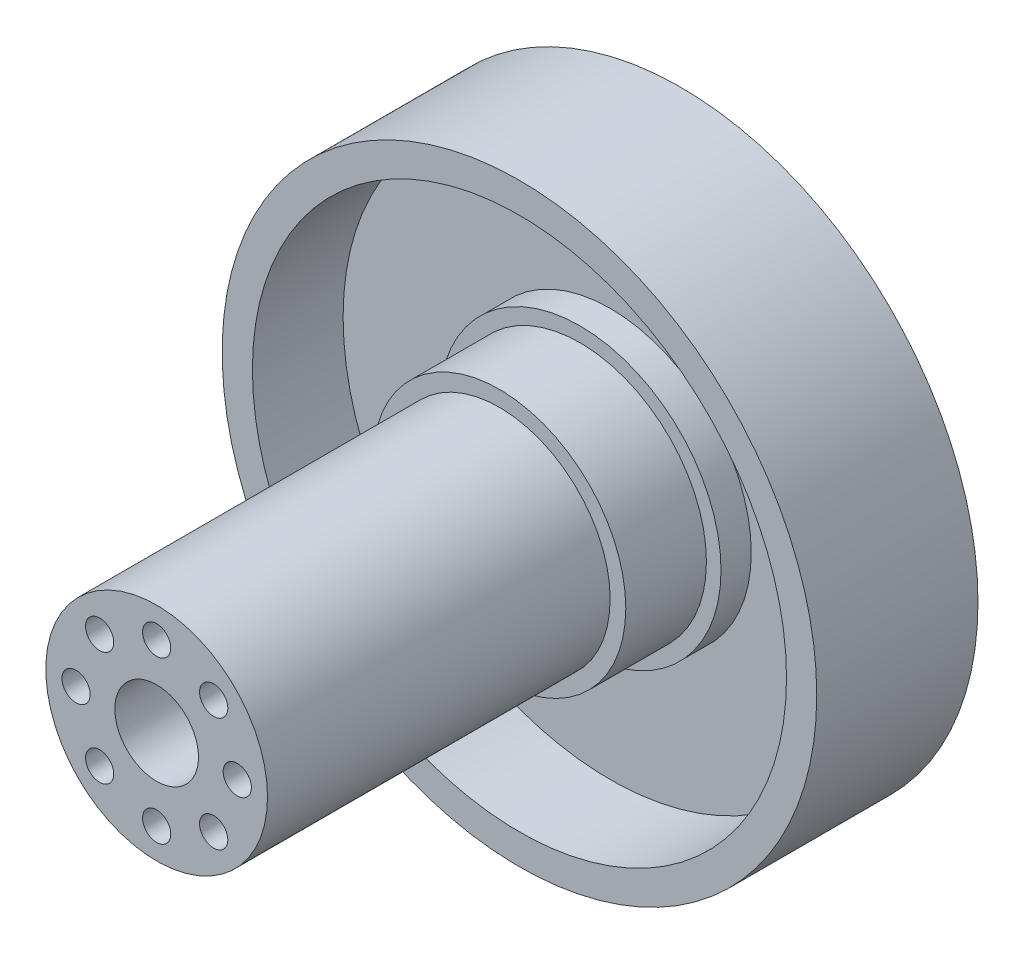
ISO-10303-21;
HEADER;
FILE_DESCRIPTION(('STEP AP214'),'2;1');
FILE_NAME('part.step','',(''),(''),'','','');
FILE_SCHEMA(('AUTOMOTIVE_DESIGN { 1 0 10303 214 1 1 1 1 }'));
ENDSEC;
DATA;
#1=APPLICATION_CONTEXT('core data for automotive mechanical design processes');
#2=APPLICATION_PROTOCOL_DEFINITION('international standard','automotive_design',2000,#1);
#3=PRODUCT_CONTEXT('',#1,'mechanical');
#4=PRODUCT('Part','Part','',(#3));
#5=PRODUCT_RELATED_PRODUCT_CATEGORY('part','',(#4));
#6=PRODUCT_DEFINITION_FORMATION('','',#4);
#7=PRODUCT_DEFINITION_CONTEXT('part definition',#1,'design');
#8=PRODUCT_DEFINITION('design','',#6,#7);
#9=PRODUCT_DEFINITION_SHAPE('','',#8);
#10=(LENGTH_UNIT() NAMED_UNIT(*) SI_UNIT(.MILLI.,.METRE.));
#11=(NAMED_UNIT(*) PLANE_ANGLE_UNIT() SI_UNIT($,.RADIAN.));
#12=(NAMED_UNIT(*) SI_UNIT($,.STERADIAN.) SOLID_ANGLE_UNIT());
#13=UNCERTAINTY_MEASURE_WITH_UNIT(LENGTH_MEASURE(1.E-05),#10,'distance_accuracy_value','');
#14=(GEOMETRIC_REPRESENTATION_CONTEXT(3) GLOBAL_UNCERTAINTY_ASSIGNED_CONTEXT((#13)) GLOBAL_UNIT_ASSIGNED_CONTEXT((#10,
#11,#12)) REPRESENTATION_CONTEXT('',''));
#15=CARTESIAN_POINT('',(0.,0.,0.));
#16=DIRECTION('',(0.,0.,1.));
#17=DIRECTION('',(1.,0.,0.));
#18=AXIS2_PLACEMENT_3D('',#15,#16,#17);
#19=CARTESIAN_POINT('',(0.,0.,7.));
#20=DIRECTION('',(0.,0.,-1.));
#21=DIRECTION('',(-1.,0.,0.));
#22=AXIS2_PLACEMENT_3D('',#19,#20,#21);
#23=CYLINDRICAL_SURFACE('',#22,29.5);
#24=CARTESIAN_POINT('',(0.,0.,0.));
#25=DIRECTION('',(0.,0.,1.));
#26=DIRECTION('',(1.,0.,0.));
#27=AXIS2_PLACEMENT_3D('',#24,#25,#26);
#28=CIRCLE('',#27,29.5);
#29=CARTESIAN_POINT('',(29.5,0.,0.));
#30=VERTEX_POINT('',#29);
#31=EDGE_CURVE('E76',#30,#30,#28,.T.);
#32=ORIENTED_EDGE('',*,*,#31,.T.);
#33=EDGE_LOOP('',(#32));
#34=FACE_BOUND('',#33,.T.);
#35=CARTESIAN_POINT('',(0.,0.,16.));
#36=DIRECTION('',(0.,0.,1.));
#37=DIRECTION('',(1.,0.,0.));
#38=AXIS2_PLACEMENT_3D('',#35,#36,#37);
#39=CIRCLE('',#38,29.5);
#40=CARTESIAN_POINT('',(29.5,0.,16.));
#41=VERTEX_POINT('',#40);
#42=EDGE_CURVE('E689',#41,#41,#39,.T.);
#43=ORIENTED_EDGE('',*,*,#42,.F.);
#44=EDGE_LOOP('',(#43));
#45=FACE_BOUND('',#44,.T.);
#46=ADVANCED_FACE('F44',(#34,#45),#23,.T.);
#47=CARTESIAN_POINT('',(0.,0.,7.));
#48=DIRECTION('',(0.,0.,1.));
#49=DIRECTION('',(1.,0.,0.));
#50=AXIS2_PLACEMENT_3D('',#47,#48,#49);
#51=PLANE('',#50);
#52=CARTESIAN_POINT('',(0.,0.,7.));
#53=DIRECTION('',(0.,0.,1.));
#54=DIRECTION('',(1.,0.,0.));
#55=AXIS2_PLACEMENT_3D('',#52,#53,#54);
#56=CIRCLE('',#55,26.5);
#57=CARTESIAN_POINT('',(26.5,0.,7.));
#58=VERTEX_POINT('',#57);
#59=EDGE_CURVE('E10',#58,#58,#56,.F.);
#60=ORIENTED_EDGE('',*,*,#59,.F.);
#61=EDGE_LOOP('',(#60));
#62=FACE_BOUND('',#61,.T.);
#63=CARTESIAN_POINT('',(0.,0.,7.));
#64=DIRECTION('',(0.,0.,1.));
#65=DIRECTION('',(1.,0.,0.));
#66=AXIS2_PLACEMENT_3D('',#63,#64,#65);
#67=CIRCLE('',#66,14.);
#68=CARTESIAN_POINT('',(14.,0.,7.));
#69=VERTEX_POINT('',#68);
#70=EDGE_CURVE('E62',#69,#69,#67,.T.);
#71=ORIENTED_EDGE('',*,*,#70,.F.);
#72=EDGE_LOOP('',(#71));
#73=FACE_BOUND('',#72,.T.);
#74=ADVANCED_FACE('F88',(#62,#73),#51,.T.);
#75=CARTESIAN_POINT('',(0.,0.,0.));
#76=DIRECTION('',(0.,0.,1.));
#77=DIRECTION('',(1.,0.,0.));
#78=AXIS2_PLACEMENT_3D('',#75,#76,#77);
#79=PLANE('',#78);
#80=CARTESIAN_POINT('',(-26.,0.,0.));
#81=DIRECTION('',(0.,0.,1.));
#82=DIRECTION('',(1.,0.,0.));
#83=AXIS2_PLACEMENT_3D('',#80,#81,#82);
#84=CIRCLE('',#83,2.07);
#85=CARTESIAN_POINT('',(-23.93,0.,0.));
#86=VERTEX_POINT('',#85);
#87=EDGE_CURVE('E709',#86,#86,#84,.T.);
#88=ORIENTED_EDGE('',*,*,#87,.T.);
#89=EDGE_LOOP('',(#88));
#90=FACE_BOUND('',#89,.T.);
#91=CARTESIAN_POINT('',(0.,26.,0.));
#92=DIRECTION('',(0.,0.,1.));
#93=DIRECTION('',(1.,0.,0.));
#94=AXIS2_PLACEMENT_3D('',#91,#92,#93);
#95=CIRCLE('',#94,2.07);
#96=CARTESIAN_POINT('',(2.07000000000009,26.,0.));
#97=VERTEX_POINT('',#96);
#98=EDGE_CURVE('E705',#97,#97,#95,.T.);
#99=ORIENTED_EDGE('',*,*,#98,.T.);
#100=EDGE_LOOP('',(#99));
#101=FACE_BOUND('',#100,.T.);
#102=CARTESIAN_POINT('',(26.,-1.81557029619843E-13,0.));
#103=DIRECTION('',(0.,0.,1.));
#104=DIRECTION('',(1.,0.,0.));
#105=AXIS2_PLACEMENT_3D('',#102,#103,#104);
#106=CIRCLE('',#105,2.07);
#107=CARTESIAN_POINT('',(28.07,-1.81557029619843E-13,0.));
#108=VERTEX_POINT('',#107);
#109=EDGE_CURVE('E697',#108,#108,#106,.T.);
#110=ORIENTED_EDGE('',*,*,#109,.T.);
#111=EDGE_LOOP('',(#110));
#112=FACE_BOUND('',#111,.T.);
#113=CARTESIAN_POINT('',(-2.72335544429764E-13,-26.,0.));
#114=DIRECTION('',(0.,0.,1.));
#115=DIRECTION('',(1.,0.,0.));
#116=AXIS2_PLACEMENT_3D('',#113,#114,#115);
#117=CIRCLE('',#116,2.07);
#118=CARTESIAN_POINT('',(2.06999999999973,-26.,0.));
#119=VERTEX_POINT('',#118);
#120=EDGE_CURVE('E688',#119,#119,#117,.T.);
#121=ORIENTED_EDGE('',*,*,#120,.T.);
#122=EDGE_LOOP('',(#121));
#123=FACE_BOUND('',#122,.T.);
#124=CARTESIAN_POINT('',(8.,0.,0.));
#125=DIRECTION('',(0.,0.,-1.));
#126=DIRECTION('',(-1.,0.,0.));
#127=AXIS2_PLACEMENT_3D('',#124,#125,#126);
#128=CIRCLE('',#127,2.1);
#129=CARTESIAN_POINT('',(5.9,0.,0.));
#130=VERTEX_POINT('',#129);
#131=EDGE_CURVE('E554',#130,#130,#128,.T.);
#132=ORIENTED_EDGE('',*,*,#131,.F.);
#133=EDGE_LOOP('',(#132));
#134=FACE_BOUND('',#133,.T.);
#135=CARTESIAN_POINT('',(5.65685424949233,5.65685424949243,0.));
#136=DIRECTION('',(0.,0.,-1.));
#137=DIRECTION('',(-1.,0.,0.));
#138=AXIS2_PLACEMENT_3D('',#135,#136,#137);
#139=CIRCLE('',#138,2.1);
#140=CARTESIAN_POINT('',(3.55685424949233,5.65685424949243,0.));
#141=VERTEX_POINT('',#140);
#142=EDGE_CURVE('E577',#141,#141,#139,.T.);
#143=ORIENTED_EDGE('',*,*,#142,.F.);
#144=EDGE_LOOP('',(#143));
#145=FACE_BOUND('',#144,.T.);
#146=CARTESIAN_POINT('',(0.,8.,0.));
#147=DIRECTION('',(0.,0.,-1.));
#148=DIRECTION('',(-1.,0.,0.));
#149=AXIS2_PLACEMENT_3D('',#146,#147,#148);
#150=CIRCLE('',#149,2.1);
#151=CARTESIAN_POINT('',(-2.10000000000009,8.,0.));
#152=VERTEX_POINT('',#151);
#153=EDGE_CURVE('E569',#152,#152,#150,.T.);
#154=ORIENTED_EDGE('',*,*,#153,.F.);
#155=EDGE_LOOP('',(#154));
#156=FACE_BOUND('',#155,.T.);
#157=CARTESIAN_POINT('',(-5.65685424949245,5.65685424949231,0.));
#158=DIRECTION('',(0.,0.,-1.));
#159=DIRECTION('',(-1.,0.,0.));
#160=AXIS2_PLACEMENT_3D('',#157,#158,#159);
#161=CIRCLE('',#160,2.1);
#162=CARTESIAN_POINT('',(-7.75685424949245,5.65685424949231,0.));
#163=VERTEX_POINT('',#162);
#164=EDGE_CURVE('E560',#163,#163,#161,.T.);
#165=ORIENTED_EDGE('',*,*,#164,.F.);
#166=EDGE_LOOP('',(#165));
#167=FACE_BOUND('',#166,.T.);
#168=CARTESIAN_POINT('',(-8.,0.,0.));
#169=DIRECTION('',(0.,0.,-1.));
#170=DIRECTION('',(-1.,0.,0.));
#171=AXIS2_PLACEMENT_3D('',#168,#169,#170);
#172=CIRCLE('',#171,2.1);
#173=CARTESIAN_POINT('',(-10.1,0.,0.));
#174=VERTEX_POINT('',#173);
#175=EDGE_CURVE('E561',#174,#174,#172,.T.);
#176=ORIENTED_EDGE('',*,*,#175,.F.);
#177=EDGE_LOOP('',(#176));
#178=FACE_BOUND('',#177,.T.);
#179=CARTESIAN_POINT('',(-5.65685424949237,-5.65685424949239,0.));
#180=DIRECTION('',(0.,0.,-1.));
#181=DIRECTION('',(-1.,0.,0.));
#182=AXIS2_PLACEMENT_3D('',#179,#180,#181);
#183=CIRCLE('',#182,2.1);
#184=CARTESIAN_POINT('',(-7.75685424949237,-5.65685424949239,0.));
#185=VERTEX_POINT('',#184);
#186=EDGE_CURVE('E601',#185,#185,#183,.T.);
#187=ORIENTED_EDGE('',*,*,#186,.F.);
#188=EDGE_LOOP('',(#187));
#189=FACE_BOUND('',#188,.T.);
#190=CARTESIAN_POINT('',(0.,-8.,0.));
#191=DIRECTION('',(0.,0.,-1.));
#192=DIRECTION('',(-1.,0.,0.));
#193=AXIS2_PLACEMENT_3D('',#190,#191,#192);
#194=CIRCLE('',#193,2.1);
#195=CARTESIAN_POINT('',(-2.09999999999997,-8.,0.));
#196=VERTEX_POINT('',#195);
#197=EDGE_CURVE('E592',#196,#196,#194,.T.);
#198=ORIENTED_EDGE('',*,*,#197,.F.);
#199=EDGE_LOOP('',(#198));
#200=FACE_BOUND('',#199,.T.);
#201=CARTESIAN_POINT('',(5.65685424949241,-5.65685424949235,0.));
#202=DIRECTION('',(0.,0.,-1.));
#203=DIRECTION('',(-1.,0.,0.));
#204=AXIS2_PLACEMENT_3D('',#201,#202,#203);
#205=CIRCLE('',#204,2.1);
#206=CARTESIAN_POINT('',(3.55685424949241,-5.65685424949235,0.));
#207=VERTEX_POINT('',#206);
#208=EDGE_CURVE('E548',#207,#207,#205,.T.);
#209=ORIENTED_EDGE('',*,*,#208,.F.);
#210=EDGE_LOOP('',(#209));
#211=FACE_BOUND('',#210,.T.);
#212=ORIENTED_EDGE('',*,*,#31,.F.);
#213=EDGE_LOOP('',(#212));
#214=FACE_BOUND('',#213,.T.);
#215=ADVANCED_FACE('F85',(#90,#101,#112,#123,#134,#145,#156,#167,#178,#189,#200,#211,#214),#79,.F.);
#216=CARTESIAN_POINT('',(0.,0.,10.));
#217=DIRECTION('',(0.,0.,-1.));
#218=DIRECTION('',(-1.,0.,0.));
#219=AXIS2_PLACEMENT_3D('',#216,#217,#218);
#220=CYLINDRICAL_SURFACE('',#219,14.);
#221=CARTESIAN_POINT('',(0.,0.,10.));
#222=DIRECTION('',(0.,0.,1.));
#223=DIRECTION('',(1.,0.,0.));
#224=AXIS2_PLACEMENT_3D('',#221,#222,#223);
#225=CIRCLE('',#224,14.);
#226=CARTESIAN_POINT('',(14.,0.,10.));
#227=VERTEX_POINT('',#226);
#228=EDGE_CURVE('E71',#227,#227,#225,.T.);
#229=ORIENTED_EDGE('',*,*,#228,.F.);
#230=EDGE_LOOP('',(#229));
#231=FACE_BOUND('',#230,.T.);
#232=ORIENTED_EDGE('',*,*,#70,.T.);
#233=EDGE_LOOP('',(#232));
#234=FACE_BOUND('',#233,.T.);
#235=ADVANCED_FACE('F87',(#231,#234),#220,.T.);
#236=CARTESIAN_POINT('',(0.,0.,10.));
#237=DIRECTION('',(0.,0.,1.));
#238=DIRECTION('',(1.,0.,0.));
#239=AXIS2_PLACEMENT_3D('',#236,#237,#238);
#240=PLANE('',#239);
#241=CARTESIAN_POINT('',(0.,0.,10.));
#242=DIRECTION('',(0.,0.,1.));
#243=DIRECTION('',(1.,0.,0.));
#244=AXIS2_PLACEMENT_3D('',#241,#242,#243);
#245=CIRCLE('',#244,12.55);
#246=CARTESIAN_POINT('',(12.55,0.,10.));
#247=VERTEX_POINT('',#246);
#248=EDGE_CURVE('E56',#247,#247,#245,.T.);
#249=ORIENTED_EDGE('',*,*,#248,.F.);
#250=EDGE_LOOP('',(#249));
#251=FACE_BOUND('',#250,.T.);
#252=ORIENTED_EDGE('',*,*,#228,.T.);
#253=EDGE_LOOP('',(#252));
#254=FACE_BOUND('',#253,.T.);
#255=ADVANCED_FACE('F95',(#251,#254),#240,.T.);
#256=CARTESIAN_POINT('',(0.,0.,18.));
#257=DIRECTION('',(0.,0.,-1.));
#258=DIRECTION('',(-1.,0.,0.));
#259=AXIS2_PLACEMENT_3D('',#256,#257,#258);
#260=CYLINDRICAL_SURFACE('',#259,12.55);
#261=CARTESIAN_POINT('',(0.,0.,18.));
#262=DIRECTION('',(0.,0.,1.));
#263=DIRECTION('',(1.,0.,0.));
#264=AXIS2_PLACEMENT_3D('',#261,#262,#263);
#265=CIRCLE('',#264,12.55);
#266=CARTESIAN_POINT('',(12.55,0.,18.));
#267=VERTEX_POINT('',#266);
#268=EDGE_CURVE('E68',#267,#267,#265,.T.);
#269=ORIENTED_EDGE('',*,*,#268,.F.);
#270=EDGE_LOOP('',(#269));
#271=FACE_BOUND('',#270,.T.);
#272=ORIENTED_EDGE('',*,*,#248,.T.);
#273=EDGE_LOOP('',(#272));
#274=FACE_BOUND('',#273,.T.);
#275=ADVANCED_FACE('F464',(#271,#274),#260,.T.);
#276=CARTESIAN_POINT('',(0.,0.,18.));
#277=DIRECTION('',(0.,0.,1.));
#278=DIRECTION('',(1.,0.,0.));
#279=AXIS2_PLACEMENT_3D('',#276,#277,#278);
#280=PLANE('',#279);
#281=CARTESIAN_POINT('',(0.,0.,18.));
#282=DIRECTION('',(0.,0.,1.));
#283=DIRECTION('',(1.,0.,0.));
#284=AXIS2_PLACEMENT_3D('',#281,#282,#283);
#285=CIRCLE('',#284,11.);
#286=CARTESIAN_POINT('',(11.,0.,18.));
#287=VERTEX_POINT('',#286);
#288=EDGE_CURVE('E51',#287,#287,#285,.T.);
#289=ORIENTED_EDGE('',*,*,#288,.F.);
#290=EDGE_LOOP('',(#289));
#291=FACE_BOUND('',#290,.T.);
#292=ORIENTED_EDGE('',*,*,#268,.T.);
#293=EDGE_LOOP('',(#292));
#294=FACE_BOUND('',#293,.T.);
#295=ADVANCED_FACE('F455',(#291,#294),#280,.T.);
#296=CARTESIAN_POINT('',(0.,0.,52.));
#297=DIRECTION('',(0.,0.,-1.));
#298=DIRECTION('',(-1.,0.,0.));
#299=AXIS2_PLACEMENT_3D('',#296,#297,#298);
#300=CYLINDRICAL_SURFACE('',#299,11.);
#301=CARTESIAN_POINT('',(0.,0.,52.));
#302=DIRECTION('',(0.,0.,1.));
#303=DIRECTION('',(1.,0.,0.));
#304=AXIS2_PLACEMENT_3D('',#301,#302,#303);
#305=CIRCLE('',#304,11.);
#306=CARTESIAN_POINT('',(11.,0.,52.));
#307=VERTEX_POINT('',#306);
#308=EDGE_CURVE('E66',#307,#307,#305,.T.);
#309=ORIENTED_EDGE('',*,*,#308,.F.);
#310=EDGE_LOOP('',(#309));
#311=FACE_BOUND('',#310,.T.);
#312=ORIENTED_EDGE('',*,*,#288,.T.);
#313=EDGE_LOOP('',(#312));
#314=FACE_BOUND('',#313,.T.);
#315=ADVANCED_FACE('F446',(#311,#314),#300,.T.);
#316=CARTESIAN_POINT('',(0.,0.,52.));
#317=DIRECTION('',(0.,0.,1.));
#318=DIRECTION('',(1.,0.,0.));
#319=AXIS2_PLACEMENT_3D('',#316,#317,#318);
#320=PLANE('',#319);
#321=CARTESIAN_POINT('',(0.,0.,52.));
#322=DIRECTION('',(0.,0.,1.));
#323=DIRECTION('',(1.,0.,0.));
#324=AXIS2_PLACEMENT_3D('',#321,#322,#323);
#325=CIRCLE('',#324,4.15);
#326=CARTESIAN_POINT('',(4.15,0.,52.));
#327=VERTEX_POINT('',#326);
#328=EDGE_CURVE('E676',#327,#327,#325,.T.);
#329=ORIENTED_EDGE('',*,*,#328,.F.);
#330=EDGE_LOOP('',(#329));
#331=FACE_BOUND('',#330,.T.);
#332=CARTESIAN_POINT('',(5.65685424949249,-5.65685424949227,52.));
#333=DIRECTION('',(0.,0.,-1.));
#334=DIRECTION('',(-1.,0.,0.));
#335=AXIS2_PLACEMENT_3D('',#332,#333,#334);
#336=CIRCLE('',#335,1.4);
#337=CARTESIAN_POINT('',(4.25685424949249,-5.65685424949227,52.));
#338=VERTEX_POINT('',#337);
#339=EDGE_CURVE('E620',#338,#338,#336,.T.);
#340=ORIENTED_EDGE('',*,*,#339,.T.);
#341=EDGE_LOOP('',(#340));
#342=FACE_BOUND('',#341,.T.);
#343=CARTESIAN_POINT('',(1.41393977029702E-13,-8.,52.));
#344=DIRECTION('',(0.,0.,-1.));
#345=DIRECTION('',(-1.,0.,0.));
#346=AXIS2_PLACEMENT_3D('',#343,#344,#345);
#347=CIRCLE('',#346,1.4);
#348=CARTESIAN_POINT('',(-1.39999999999986,-8.,52.));
#349=VERTEX_POINT('',#348);
#350=EDGE_CURVE('E629',#349,#349,#347,.T.);
#351=ORIENTED_EDGE('',*,*,#350,.T.);
#352=EDGE_LOOP('',(#351));
#353=FACE_BOUND('',#352,.T.);
#354=CARTESIAN_POINT('',(-5.65685424949229,-5.65685424949247,52.));
#355=DIRECTION('',(0.,0.,-1.));
#356=DIRECTION('',(-1.,0.,0.));
#357=AXIS2_PLACEMENT_3D('',#354,#355,#356);
#358=CIRCLE('',#357,1.4);
#359=CARTESIAN_POINT('',(-7.05685424949229,-5.65685424949247,52.));
#360=VERTEX_POINT('',#359);
#361=EDGE_CURVE('E637',#360,#360,#358,.T.);
#362=ORIENTED_EDGE('',*,*,#361,.T.);
#363=EDGE_LOOP('',(#362));
#364=FACE_BOUND('',#363,.T.);
#365=CARTESIAN_POINT('',(-8.,-1.1172740284298E-13,52.));
#366=DIRECTION('',(0.,0.,-1.));
#367=DIRECTION('',(-1.,0.,0.));
#368=AXIS2_PLACEMENT_3D('',#365,#366,#367);
#369=CIRCLE('',#368,1.4);
#370=CARTESIAN_POINT('',(-9.4,-1.1172740284298E-13,52.));
#371=VERTEX_POINT('',#370);
#372=EDGE_CURVE('E645',#371,#371,#369,.T.);
#373=ORIENTED_EDGE('',*,*,#372,.T.);
#374=EDGE_LOOP('',(#373));
#375=FACE_BOUND('',#374,.T.);
#376=CARTESIAN_POINT('',(-5.65685424949245,5.65685424949231,52.));
#377=DIRECTION('',(0.,0.,-1.));
#378=DIRECTION('',(-1.,0.,0.));
#379=AXIS2_PLACEMENT_3D('',#376,#377,#378);
#380=CIRCLE('',#379,1.4);
#381=CARTESIAN_POINT('',(-7.05685424949245,5.65685424949231,52.));
#382=VERTEX_POINT('',#381);
#383=EDGE_CURVE('E653',#382,#382,#380,.T.);
#384=ORIENTED_EDGE('',*,*,#383,.T.);
#385=EDGE_LOOP('',(#384));
#386=FACE_BOUND('',#385,.T.);
#387=CARTESIAN_POINT('',(0.,8.,52.));
#388=DIRECTION('',(0.,0.,-1.));
#389=DIRECTION('',(-1.,0.,0.));
#390=AXIS2_PLACEMENT_3D('',#387,#388,#389);
#391=CIRCLE('',#390,1.4);
#392=CARTESIAN_POINT('',(-1.40000000000008,8.,52.));
#393=VERTEX_POINT('',#392);
#394=EDGE_CURVE('E661',#393,#393,#391,.T.);
#395=ORIENTED_EDGE('',*,*,#394,.T.);
#396=EDGE_LOOP('',(#395));
#397=FACE_BOUND('',#396,.T.);
#398=CARTESIAN_POINT('',(5.65685424949233,5.65685424949243,52.));
#399=DIRECTION('',(0.,0.,-1.));
#400=DIRECTION('',(-1.,0.,0.));
#401=AXIS2_PLACEMENT_3D('',#398,#399,#400);
#402=CIRCLE('',#401,1.4);
#403=CARTESIAN_POINT('',(4.25685424949233,5.65685424949243,52.));
#404=VERTEX_POINT('',#403);
#405=EDGE_CURVE('E669',#404,#404,#402,.T.);
#406=ORIENTED_EDGE('',*,*,#405,.T.);
#407=EDGE_LOOP('',(#406));
#408=FACE_BOUND('',#407,.T.);
#409=CARTESIAN_POINT('',(8.,0.,52.));
#410=DIRECTION('',(0.,0.,-1.));
#411=DIRECTION('',(-1.,0.,0.));
#412=AXIS2_PLACEMENT_3D('',#409,#410,#411);
#413=CIRCLE('',#412,1.4);
#414=CARTESIAN_POINT('',(6.6,0.,52.));
#415=VERTEX_POINT('',#414);
#416=EDGE_CURVE('E593',#415,#415,#413,.T.);
#417=ORIENTED_EDGE('',*,*,#416,.T.);
#418=EDGE_LOOP('',(#417));
#419=FACE_BOUND('',#418,.T.);
#420=ORIENTED_EDGE('',*,*,#308,.T.);
#421=EDGE_LOOP('',(#420));
#422=FACE_BOUND('',#421,.T.);
#423=ADVANCED_FACE('F437',(#331,#342,#353,#364,#375,#386,#397,#408,#419,#422),#320,.T.);
#424=CARTESIAN_POINT('',(5.65685424949241,-5.65685424949235,33.8));
#425=DIRECTION('',(0.,0.,-1.));
#426=DIRECTION('',(-1.,0.,0.));
#427=AXIS2_PLACEMENT_3D('',#424,#425,#426);
#428=CYLINDRICAL_SURFACE('',#427,2.1);
#429=CARTESIAN_POINT('',(5.65685424949241,-5.65685424949235,33.8));
#430=DIRECTION('',(0.,0.,-1.));
#431=DIRECTION('',(-1.,0.,0.));
#432=AXIS2_PLACEMENT_3D('',#429,#430,#431);
#433=CIRCLE('',#432,2.1);
#434=CARTESIAN_POINT('',(3.55685424949241,-5.65685424949235,33.8));
#435=VERTEX_POINT('',#434);
#436=EDGE_CURVE('E545',#435,#435,#433,.T.);
#437=ORIENTED_EDGE('',*,*,#436,.F.);
#438=EDGE_LOOP('',(#437));
#439=FACE_BOUND('',#438,.T.);
#440=ORIENTED_EDGE('',*,*,#208,.T.);
#441=EDGE_LOOP('',(#440));
#442=FACE_BOUND('',#441,.T.);
#443=ADVANCED_FACE('F428',(#439,#442),#428,.F.);
#444=CARTESIAN_POINT('',(5.65685424949241,-5.65685424949235,33.8));
#445=DIRECTION('',(0.,0.,-1.));
#446=DIRECTION('',(-1.,0.,0.));
#447=AXIS2_PLACEMENT_3D('',#444,#445,#446);
#448=PLANE('',#447);
#449=CARTESIAN_POINT('',(5.65685424949249,-5.65685424949227,33.8));
#450=DIRECTION('',(0.,0.,-1.));
#451=DIRECTION('',(-1.,0.,0.));
#452=AXIS2_PLACEMENT_3D('',#449,#450,#451);
#453=CIRCLE('',#452,1.4);
#454=CARTESIAN_POINT('',(4.25685424949249,-5.65685424949227,33.8));
#455=VERTEX_POINT('',#454);
#456=EDGE_CURVE('E624',#455,#455,#453,.T.);
#457=ORIENTED_EDGE('',*,*,#456,.F.);
#458=EDGE_LOOP('',(#457));
#459=FACE_BOUND('',#458,.T.);
#460=ORIENTED_EDGE('',*,*,#436,.T.);
#461=EDGE_LOOP('',(#460));
#462=FACE_BOUND('',#461,.T.);
#463=ADVANCED_FACE('F419',(#459,#462),#448,.T.);
#464=CARTESIAN_POINT('',(0.,-8.,33.8));
#465=DIRECTION('',(0.,0.,-1.));
#466=DIRECTION('',(-1.,0.,0.));
#467=AXIS2_PLACEMENT_3D('',#464,#465,#466);
#468=CYLINDRICAL_SURFACE('',#467,2.1);
#469=CARTESIAN_POINT('',(0.,-8.,33.8));
#470=DIRECTION('',(0.,0.,-1.));
#471=DIRECTION('',(-1.,0.,0.));
#472=AXIS2_PLACEMENT_3D('',#469,#470,#471);
#473=CIRCLE('',#472,2.1);
#474=CARTESIAN_POINT('',(-2.09999999999997,-8.,33.8));
#475=VERTEX_POINT('',#474);
#476=EDGE_CURVE('E588',#475,#475,#473,.T.);
#477=ORIENTED_EDGE('',*,*,#476,.F.);
#478=EDGE_LOOP('',(#477));
#479=FACE_BOUND('',#478,.T.);
#480=ORIENTED_EDGE('',*,*,#197,.T.);
#481=EDGE_LOOP('',(#480));
#482=FACE_BOUND('',#481,.T.);
#483=ADVANCED_FACE('F410',(#479,#482),#468,.F.);
#484=CARTESIAN_POINT('',(0.,-8.,33.8));
#485=DIRECTION('',(0.,0.,-1.));
#486=DIRECTION('',(-1.,0.,0.));
#487=AXIS2_PLACEMENT_3D('',#484,#485,#486);
#488=PLANE('',#487);
#489=CARTESIAN_POINT('',(1.41393977029702E-13,-8.,33.8));
#490=DIRECTION('',(0.,0.,-1.));
#491=DIRECTION('',(-1.,0.,0.));
#492=AXIS2_PLACEMENT_3D('',#489,#490,#491);
#493=CIRCLE('',#492,1.4);
#494=CARTESIAN_POINT('',(-1.39999999999986,-8.,33.8));
#495=VERTEX_POINT('',#494);
#496=EDGE_CURVE('E633',#495,#495,#493,.T.);
#497=ORIENTED_EDGE('',*,*,#496,.F.);
#498=EDGE_LOOP('',(#497));
#499=FACE_BOUND('',#498,.T.);
#500=ORIENTED_EDGE('',*,*,#476,.T.);
#501=EDGE_LOOP('',(#500));
#502=FACE_BOUND('',#501,.T.);
#503=ADVANCED_FACE('F401',(#499,#502),#488,.T.);
#504=CARTESIAN_POINT('',(-5.65685424949237,-5.65685424949239,33.8));
#505=DIRECTION('',(0.,0.,-1.));
#506=DIRECTION('',(-1.,0.,0.));
#507=AXIS2_PLACEMENT_3D('',#504,#505,#506);
#508=CYLINDRICAL_SURFACE('',#507,2.1);
#509=CARTESIAN_POINT('',(-5.65685424949237,-5.65685424949239,33.8));
#510=DIRECTION('',(0.,0.,-1.));
#511=DIRECTION('',(-1.,0.,0.));
#512=AXIS2_PLACEMENT_3D('',#509,#510,#511);
#513=CIRCLE('',#512,2.1);
#514=CARTESIAN_POINT('',(-7.75685424949237,-5.65685424949239,33.8));
#515=VERTEX_POINT('',#514);
#516=EDGE_CURVE('E597',#515,#515,#513,.T.);
#517=ORIENTED_EDGE('',*,*,#516,.F.);
#518=EDGE_LOOP('',(#517));
#519=FACE_BOUND('',#518,.T.);
#520=ORIENTED_EDGE('',*,*,#186,.T.);
#521=EDGE_LOOP('',(#520));
#522=FACE_BOUND('',#521,.T.);
#523=ADVANCED_FACE('F392',(#519,#522),#508,.F.);
#524=CARTESIAN_POINT('',(-5.65685424949237,-5.65685424949239,33.8));
#525=DIRECTION('',(0.,0.,-1.));
#526=DIRECTION('',(-1.,0.,0.));
#527=AXIS2_PLACEMENT_3D('',#524,#525,#526);
#528=PLANE('',#527);
#529=CARTESIAN_POINT('',(-5.65685424949229,-5.65685424949247,33.8));
#530=DIRECTION('',(0.,0.,-1.));
#531=DIRECTION('',(-1.,0.,0.));
#532=AXIS2_PLACEMENT_3D('',#529,#530,#531);
#533=CIRCLE('',#532,1.4);
#534=CARTESIAN_POINT('',(-7.05685424949229,-5.65685424949247,33.8));
#535=VERTEX_POINT('',#534);
#536=EDGE_CURVE('E641',#535,#535,#533,.T.);
#537=ORIENTED_EDGE('',*,*,#536,.F.);
#538=EDGE_LOOP('',(#537));
#539=FACE_BOUND('',#538,.T.);
#540=ORIENTED_EDGE('',*,*,#516,.T.);
#541=EDGE_LOOP('',(#540));
#542=FACE_BOUND('',#541,.T.);
#543=ADVANCED_FACE('F383',(#539,#542),#528,.T.);
#544=CARTESIAN_POINT('',(-8.,0.,33.8));
#545=DIRECTION('',(0.,0.,-1.));
#546=DIRECTION('',(-1.,0.,0.));
#547=AXIS2_PLACEMENT_3D('',#544,#545,#546);
#548=CYLINDRICAL_SURFACE('',#547,2.1);
#549=CARTESIAN_POINT('',(-8.,0.,33.8));
#550=DIRECTION('',(0.,0.,-1.));
#551=DIRECTION('',(-1.,0.,0.));
#552=AXIS2_PLACEMENT_3D('',#549,#550,#551);
#553=CIRCLE('',#552,2.1);
#554=CARTESIAN_POINT('',(-10.1,0.,33.8));
#555=VERTEX_POINT('',#554);
#556=EDGE_CURVE('E605',#555,#555,#553,.T.);
#557=ORIENTED_EDGE('',*,*,#556,.F.);
#558=EDGE_LOOP('',(#557));
#559=FACE_BOUND('',#558,.T.);
#560=ORIENTED_EDGE('',*,*,#175,.T.);
#561=EDGE_LOOP('',(#560));
#562=FACE_BOUND('',#561,.T.);
#563=ADVANCED_FACE('F374',(#559,#562),#548,.F.);
#564=CARTESIAN_POINT('',(-8.,0.,33.8));
#565=DIRECTION('',(0.,0.,-1.));
#566=DIRECTION('',(-1.,0.,0.));
#567=AXIS2_PLACEMENT_3D('',#564,#565,#566);
#568=PLANE('',#567);
#569=CARTESIAN_POINT('',(-8.,-1.1172740284298E-13,33.8));
#570=DIRECTION('',(0.,0.,-1.));
#571=DIRECTION('',(-1.,0.,0.));
#572=AXIS2_PLACEMENT_3D('',#569,#570,#571);
#573=CIRCLE('',#572,1.4);
#574=CARTESIAN_POINT('',(-9.4,-1.1172740284298E-13,33.8));
#575=VERTEX_POINT('',#574);
#576=EDGE_CURVE('E649',#575,#575,#573,.T.);
#577=ORIENTED_EDGE('',*,*,#576,.F.);
#578=EDGE_LOOP('',(#577));
#579=FACE_BOUND('',#578,.T.);
#580=ORIENTED_EDGE('',*,*,#556,.T.);
#581=EDGE_LOOP('',(#580));
#582=FACE_BOUND('',#581,.T.);
#583=ADVANCED_FACE('F365',(#579,#582),#568,.T.);
#584=CARTESIAN_POINT('',(-5.65685424949245,5.65685424949231,33.8));
#585=DIRECTION('',(0.,0.,-1.));
#586=DIRECTION('',(-1.,0.,0.));
#587=AXIS2_PLACEMENT_3D('',#584,#585,#586);
#588=CYLINDRICAL_SURFACE('',#587,2.1);
#589=CARTESIAN_POINT('',(-5.65685424949245,5.65685424949231,33.8));
#590=DIRECTION('',(0.,0.,-1.));
#591=DIRECTION('',(-1.,0.,0.));
#592=AXIS2_PLACEMENT_3D('',#589,#590,#591);
#593=CIRCLE('',#592,2.1);
#594=CARTESIAN_POINT('',(-7.75685424949245,5.65685424949231,33.8));
#595=VERTEX_POINT('',#594);
#596=EDGE_CURVE('E556',#595,#595,#593,.T.);
#597=ORIENTED_EDGE('',*,*,#596,.F.);
#598=EDGE_LOOP('',(#597));
#599=FACE_BOUND('',#598,.T.);
#600=ORIENTED_EDGE('',*,*,#164,.T.);
#601=EDGE_LOOP('',(#600));
#602=FACE_BOUND('',#601,.T.);
#603=ADVANCED_FACE('F356',(#599,#602),#588,.F.);
#604=CARTESIAN_POINT('',(-5.65685424949245,5.65685424949231,33.8));
#605=DIRECTION('',(0.,0.,-1.));
#606=DIRECTION('',(-1.,0.,0.));
#607=AXIS2_PLACEMENT_3D('',#604,#605,#606);
#608=PLANE('',#607);
#609=CARTESIAN_POINT('',(-5.65685424949245,5.65685424949231,33.8));
#610=DIRECTION('',(0.,0.,-1.));
#611=DIRECTION('',(-1.,0.,0.));
#612=AXIS2_PLACEMENT_3D('',#609,#610,#611);
#613=CIRCLE('',#612,1.4);
#614=CARTESIAN_POINT('',(-7.05685424949245,5.65685424949231,33.8));
#615=VERTEX_POINT('',#614);
#616=EDGE_CURVE('E657',#615,#615,#613,.T.);
#617=ORIENTED_EDGE('',*,*,#616,.F.);
#618=EDGE_LOOP('',(#617));
#619=FACE_BOUND('',#618,.T.);
#620=ORIENTED_EDGE('',*,*,#596,.T.);
#621=EDGE_LOOP('',(#620));
#622=FACE_BOUND('',#621,.T.);
#623=ADVANCED_FACE('F347',(#619,#622),#608,.T.);
#624=CARTESIAN_POINT('',(0.,8.,33.8));
#625=DIRECTION('',(0.,0.,-1.));
#626=DIRECTION('',(-1.,0.,0.));
#627=AXIS2_PLACEMENT_3D('',#624,#625,#626);
#628=CYLINDRICAL_SURFACE('',#627,2.1);
#629=CARTESIAN_POINT('',(0.,8.,33.8));
#630=DIRECTION('',(0.,0.,-1.));
#631=DIRECTION('',(-1.,0.,0.));
#632=AXIS2_PLACEMENT_3D('',#629,#630,#631);
#633=CIRCLE('',#632,2.1);
#634=CARTESIAN_POINT('',(-2.10000000000009,8.,33.8));
#635=VERTEX_POINT('',#634);
#636=EDGE_CURVE('E565',#635,#635,#633,.T.);
#637=ORIENTED_EDGE('',*,*,#636,.F.);
#638=EDGE_LOOP('',(#637));
#639=FACE_BOUND('',#638,.T.);
#640=ORIENTED_EDGE('',*,*,#153,.T.);
#641=EDGE_LOOP('',(#640));
#642=FACE_BOUND('',#641,.T.);
#643=ADVANCED_FACE('F338',(#639,#642),#628,.F.);
#644=CARTESIAN_POINT('',(0.,8.,33.8));
#645=DIRECTION('',(0.,0.,-1.));
#646=DIRECTION('',(-1.,0.,0.));
#647=AXIS2_PLACEMENT_3D('',#644,#645,#646);
#648=PLANE('',#647);
#649=CARTESIAN_POINT('',(0.,8.,33.8));
#650=DIRECTION('',(0.,0.,-1.));
#651=DIRECTION('',(-1.,0.,0.));
#652=AXIS2_PLACEMENT_3D('',#649,#650,#651);
#653=CIRCLE('',#652,1.4);
#654=CARTESIAN_POINT('',(-1.40000000000008,8.,33.8));
#655=VERTEX_POINT('',#654);
#656=EDGE_CURVE('E665',#655,#655,#653,.T.);
#657=ORIENTED_EDGE('',*,*,#656,.F.);
#658=EDGE_LOOP('',(#657));
#659=FACE_BOUND('',#658,.T.);
#660=ORIENTED_EDGE('',*,*,#636,.T.);
#661=EDGE_LOOP('',(#660));
#662=FACE_BOUND('',#661,.T.);
#663=ADVANCED_FACE('F329',(#659,#662),#648,.T.);
#664=CARTESIAN_POINT('',(5.65685424949233,5.65685424949243,33.8));
#665=DIRECTION('',(0.,0.,-1.));
#666=DIRECTION('',(-1.,0.,0.));
#667=AXIS2_PLACEMENT_3D('',#664,#665,#666);
#668=CYLINDRICAL_SURFACE('',#667,2.1);
#669=CARTESIAN_POINT('',(5.65685424949233,5.65685424949243,33.8));
#670=DIRECTION('',(0.,0.,-1.));
#671=DIRECTION('',(-1.,0.,0.));
#672=AXIS2_PLACEMENT_3D('',#669,#670,#671);
#673=CIRCLE('',#672,2.1);
#674=CARTESIAN_POINT('',(3.55685424949233,5.65685424949243,33.8));
#675=VERTEX_POINT('',#674);
#676=EDGE_CURVE('E573',#675,#675,#673,.T.);
#677=ORIENTED_EDGE('',*,*,#676,.F.);
#678=EDGE_LOOP('',(#677));
#679=FACE_BOUND('',#678,.T.);
#680=ORIENTED_EDGE('',*,*,#142,.T.);
#681=EDGE_LOOP('',(#680));
#682=FACE_BOUND('',#681,.T.);
#683=ADVANCED_FACE('F320',(#679,#682),#668,.F.);
#684=CARTESIAN_POINT('',(5.65685424949233,5.65685424949243,33.8));
#685=DIRECTION('',(0.,0.,-1.));
#686=DIRECTION('',(-1.,0.,0.));
#687=AXIS2_PLACEMENT_3D('',#684,#685,#686);
#688=PLANE('',#687);
#689=CARTESIAN_POINT('',(5.65685424949233,5.65685424949243,33.8));
#690=DIRECTION('',(0.,0.,-1.));
#691=DIRECTION('',(-1.,0.,0.));
#692=AXIS2_PLACEMENT_3D('',#689,#690,#691);
#693=CIRCLE('',#692,1.4);
#694=CARTESIAN_POINT('',(4.25685424949233,5.65685424949243,33.8));
#695=VERTEX_POINT('',#694);
#696=EDGE_CURVE('E616',#695,#695,#693,.T.);
#697=ORIENTED_EDGE('',*,*,#696,.F.);
#698=EDGE_LOOP('',(#697));
#699=FACE_BOUND('',#698,.T.);
#700=ORIENTED_EDGE('',*,*,#676,.T.);
#701=EDGE_LOOP('',(#700));
#702=FACE_BOUND('',#701,.T.);
#703=ADVANCED_FACE('F311',(#699,#702),#688,.T.);
#704=CARTESIAN_POINT('',(8.,0.,33.8));
#705=DIRECTION('',(0.,0.,-1.));
#706=DIRECTION('',(-1.,0.,0.));
#707=AXIS2_PLACEMENT_3D('',#704,#705,#706);
#708=CYLINDRICAL_SURFACE('',#707,2.1);
#709=CARTESIAN_POINT('',(8.,0.,33.8));
#710=DIRECTION('',(0.,0.,-1.));
#711=DIRECTION('',(-1.,0.,0.));
#712=AXIS2_PLACEMENT_3D('',#709,#710,#711);
#713=CIRCLE('',#712,2.1);
#714=CARTESIAN_POINT('',(5.9,0.,33.8));
#715=VERTEX_POINT('',#714);
#716=EDGE_CURVE('E581',#715,#715,#713,.T.);
#717=ORIENTED_EDGE('',*,*,#716,.F.);
#718=EDGE_LOOP('',(#717));
#719=FACE_BOUND('',#718,.T.);
#720=ORIENTED_EDGE('',*,*,#131,.T.);
#721=EDGE_LOOP('',(#720));
#722=FACE_BOUND('',#721,.T.);
#723=ADVANCED_FACE('F302',(#719,#722),#708,.F.);
#724=CARTESIAN_POINT('',(8.,0.,33.8));
#725=DIRECTION('',(0.,0.,-1.));
#726=DIRECTION('',(-1.,0.,0.));
#727=AXIS2_PLACEMENT_3D('',#724,#725,#726);
#728=PLANE('',#727);
#729=CARTESIAN_POINT('',(8.,0.,33.8));
#730=DIRECTION('',(0.,0.,-1.));
#731=DIRECTION('',(-1.,0.,0.));
#732=AXIS2_PLACEMENT_3D('',#729,#730,#731);
#733=CIRCLE('',#732,1.4);
#734=CARTESIAN_POINT('',(6.6,0.,33.8));
#735=VERTEX_POINT('',#734);
#736=EDGE_CURVE('E612',#735,#735,#733,.T.);
#737=ORIENTED_EDGE('',*,*,#736,.F.);
#738=EDGE_LOOP('',(#737));
#739=FACE_BOUND('',#738,.T.);
#740=ORIENTED_EDGE('',*,*,#716,.T.);
#741=EDGE_LOOP('',(#740));
#742=FACE_BOUND('',#741,.T.);
#743=ADVANCED_FACE('F293',(#739,#742),#728,.T.);
#744=CARTESIAN_POINT('',(8.,0.,52.));
#745=DIRECTION('',(0.,0.,-1.));
#746=DIRECTION('',(-1.,0.,0.));
#747=AXIS2_PLACEMENT_3D('',#744,#745,#746);
#748=CYLINDRICAL_SURFACE('',#747,1.4);
#749=ORIENTED_EDGE('',*,*,#416,.F.);
#750=EDGE_LOOP('',(#749));
#751=FACE_BOUND('',#750,.T.);
#752=ORIENTED_EDGE('',*,*,#736,.T.);
#753=EDGE_LOOP('',(#752));
#754=FACE_BOUND('',#753,.T.);
#755=ADVANCED_FACE('F284',(#751,#754),#748,.F.);
#756=CARTESIAN_POINT('',(5.65685424949233,5.65685424949243,52.));
#757=DIRECTION('',(0.,0.,-1.));
#758=DIRECTION('',(-1.,0.,0.));
#759=AXIS2_PLACEMENT_3D('',#756,#757,#758);
#760=CYLINDRICAL_SURFACE('',#759,1.4);
#761=ORIENTED_EDGE('',*,*,#405,.F.);
#762=EDGE_LOOP('',(#761));
#763=FACE_BOUND('',#762,.T.);
#764=ORIENTED_EDGE('',*,*,#696,.T.);
#765=EDGE_LOOP('',(#764));
#766=FACE_BOUND('',#765,.T.);
#767=ADVANCED_FACE('F275',(#763,#766),#760,.F.);
#768=CARTESIAN_POINT('',(0.,8.,52.));
#769=DIRECTION('',(0.,0.,-1.));
#770=DIRECTION('',(-1.,0.,0.));
#771=AXIS2_PLACEMENT_3D('',#768,#769,#770);
#772=CYLINDRICAL_SURFACE('',#771,1.4);
#773=ORIENTED_EDGE('',*,*,#394,.F.);
#774=EDGE_LOOP('',(#773));
#775=FACE_BOUND('',#774,.T.);
#776=ORIENTED_EDGE('',*,*,#656,.T.);
#777=EDGE_LOOP('',(#776));
#778=FACE_BOUND('',#777,.T.);
#779=ADVANCED_FACE('F266',(#775,#778),#772,.F.);
#780=CARTESIAN_POINT('',(-5.65685424949245,5.65685424949231,52.));
#781=DIRECTION('',(0.,0.,-1.));
#782=DIRECTION('',(-1.,0.,0.));
#783=AXIS2_PLACEMENT_3D('',#780,#781,#782);
#784=CYLINDRICAL_SURFACE('',#783,1.4);
#785=ORIENTED_EDGE('',*,*,#383,.F.);
#786=EDGE_LOOP('',(#785));
#787=FACE_BOUND('',#786,.T.);
#788=ORIENTED_EDGE('',*,*,#616,.T.);
#789=EDGE_LOOP('',(#788));
#790=FACE_BOUND('',#789,.T.);
#791=ADVANCED_FACE('F257',(#787,#790),#784,.F.);
#792=CARTESIAN_POINT('',(-8.,-1.1172740284298E-13,52.));
#793=DIRECTION('',(0.,0.,-1.));
#794=DIRECTION('',(-1.,0.,0.));
#795=AXIS2_PLACEMENT_3D('',#792,#793,#794);
#796=CYLINDRICAL_SURFACE('',#795,1.4);
#797=ORIENTED_EDGE('',*,*,#372,.F.);
#798=EDGE_LOOP('',(#797));
#799=FACE_BOUND('',#798,.T.);
#800=ORIENTED_EDGE('',*,*,#576,.T.);
#801=EDGE_LOOP('',(#800));
#802=FACE_BOUND('',#801,.T.);
#803=ADVANCED_FACE('F248',(#799,#802),#796,.F.);
#804=CARTESIAN_POINT('',(-5.65685424949229,-5.65685424949247,52.));
#805=DIRECTION('',(0.,0.,-1.));
#806=DIRECTION('',(-1.,0.,0.));
#807=AXIS2_PLACEMENT_3D('',#804,#805,#806);
#808=CYLINDRICAL_SURFACE('',#807,1.4);
#809=ORIENTED_EDGE('',*,*,#361,.F.);
#810=EDGE_LOOP('',(#809));
#811=FACE_BOUND('',#810,.T.);
#812=ORIENTED_EDGE('',*,*,#536,.T.);
#813=EDGE_LOOP('',(#812));
#814=FACE_BOUND('',#813,.T.);
#815=ADVANCED_FACE('F239',(#811,#814),#808,.F.);
#816=CARTESIAN_POINT('',(1.41393977029702E-13,-8.,52.));
#817=DIRECTION('',(0.,0.,-1.));
#818=DIRECTION('',(-1.,0.,0.));
#819=AXIS2_PLACEMENT_3D('',#816,#817,#818);
#820=CYLINDRICAL_SURFACE('',#819,1.4);
#821=ORIENTED_EDGE('',*,*,#350,.F.);
#822=EDGE_LOOP('',(#821));
#823=FACE_BOUND('',#822,.T.);
#824=ORIENTED_EDGE('',*,*,#496,.T.);
#825=EDGE_LOOP('',(#824));
#826=FACE_BOUND('',#825,.T.);
#827=ADVANCED_FACE('F230',(#823,#826),#820,.F.);
#828=CARTESIAN_POINT('',(5.65685424949249,-5.65685424949227,52.));
#829=DIRECTION('',(0.,0.,-1.));
#830=DIRECTION('',(-1.,0.,0.));
#831=AXIS2_PLACEMENT_3D('',#828,#829,#830);
#832=CYLINDRICAL_SURFACE('',#831,1.4);
#833=ORIENTED_EDGE('',*,*,#339,.F.);
#834=EDGE_LOOP('',(#833));
#835=FACE_BOUND('',#834,.T.);
#836=ORIENTED_EDGE('',*,*,#456,.T.);
#837=EDGE_LOOP('',(#836));
#838=FACE_BOUND('',#837,.T.);
#839=ADVANCED_FACE('F221',(#835,#838),#832,.F.);
#840=CARTESIAN_POINT('',(0.,0.,43.));
#841=DIRECTION('',(0.,0.,1.));
#842=DIRECTION('',(1.,0.,0.));
#843=AXIS2_PLACEMENT_3D('',#840,#841,#842);
#844=CYLINDRICAL_SURFACE('',#843,4.15);
#845=CARTESIAN_POINT('',(0.,0.,43.));
#846=DIRECTION('',(0.,0.,1.));
#847=DIRECTION('',(1.,0.,0.));
#848=AXIS2_PLACEMENT_3D('',#845,#846,#847);
#849=CIRCLE('',#848,4.15);
#850=CARTESIAN_POINT('',(4.15,0.,43.));
#851=VERTEX_POINT('',#850);
#852=EDGE_CURVE('E625',#851,#851,#849,.T.);
#853=ORIENTED_EDGE('',*,*,#852,.F.);
#854=EDGE_LOOP('',(#853));
#855=FACE_BOUND('',#854,.T.);
#856=ORIENTED_EDGE('',*,*,#328,.T.);
#857=EDGE_LOOP('',(#856));
#858=FACE_BOUND('',#857,.T.);
#859=ADVANCED_FACE('F212',(#855,#858),#844,.F.);
#860=CARTESIAN_POINT('',(0.,0.,43.));
#861=DIRECTION('',(0.,0.,1.));
#862=DIRECTION('',(1.,0.,0.));
#863=AXIS2_PLACEMENT_3D('',#860,#861,#862);
#864=PLANE('',#863);
#865=ORIENTED_EDGE('',*,*,#852,.T.);
#866=EDGE_LOOP('',(#865));
#867=FACE_BOUND('',#866,.T.);
#868=ADVANCED_FACE('F204',(#867),#864,.T.);
#869=CARTESIAN_POINT('',(-2.72335544429764E-13,-26.,5.));
#870=DIRECTION('',(0.,0.,-1.));
#871=DIRECTION('',(-1.,0.,0.));
#872=AXIS2_PLACEMENT_3D('',#869,#870,#871);
#873=CYLINDRICAL_SURFACE('',#872,2.07);
#874=CARTESIAN_POINT('',(-2.72335544429764E-13,-26.,5.));
#875=DIRECTION('',(0.,0.,1.));
#876=DIRECTION('',(1.,0.,0.));
#877=AXIS2_PLACEMENT_3D('',#874,#875,#876);
#878=CIRCLE('',#877,2.07);
#879=CARTESIAN_POINT('',(2.06999999999973,-26.,5.));
#880=VERTEX_POINT('',#879);
#881=EDGE_CURVE('E684',#880,#880,#878,.T.);
#882=ORIENTED_EDGE('',*,*,#881,.T.);
#883=EDGE_LOOP('',(#882));
#884=FACE_BOUND('',#883,.T.);
#885=ORIENTED_EDGE('',*,*,#120,.F.);
#886=EDGE_LOOP('',(#885));
#887=FACE_BOUND('',#886,.T.);
#888=ADVANCED_FACE('F196',(#884,#887),#873,.F.);
#889=CARTESIAN_POINT('',(-2.72335544429764E-13,-26.,5.));
#890=DIRECTION('',(0.,0.,1.));
#891=DIRECTION('',(1.,0.,0.));
#892=AXIS2_PLACEMENT_3D('',#889,#890,#891);
#893=PLANE('',#892);
#894=ORIENTED_EDGE('',*,*,#881,.F.);
#895=EDGE_LOOP('',(#894));
#896=FACE_BOUND('',#895,.T.);
#897=ADVANCED_FACE('F187',(#896),#893,.F.);
#898=CARTESIAN_POINT('',(26.,-1.81557029619843E-13,5.));
#899=DIRECTION('',(0.,0.,-1.));
#900=DIRECTION('',(-1.,0.,0.));
#901=AXIS2_PLACEMENT_3D('',#898,#899,#900);
#902=CYLINDRICAL_SURFACE('',#901,2.07);
#903=CARTESIAN_POINT('',(26.,-1.81557029619843E-13,5.));
#904=DIRECTION('',(0.,0.,1.));
#905=DIRECTION('',(1.,0.,0.));
#906=AXIS2_PLACEMENT_3D('',#903,#904,#905);
#907=CIRCLE('',#906,2.07);
#908=CARTESIAN_POINT('',(28.07,-1.81557029619843E-13,5.));
#909=VERTEX_POINT('',#908);
#910=EDGE_CURVE('E693',#909,#909,#907,.T.);
#911=ORIENTED_EDGE('',*,*,#910,.T.);
#912=EDGE_LOOP('',(#911));
#913=FACE_BOUND('',#912,.T.);
#914=ORIENTED_EDGE('',*,*,#109,.F.);
#915=EDGE_LOOP('',(#914));
#916=FACE_BOUND('',#915,.T.);
#917=ADVANCED_FACE('F178',(#913,#916),#902,.F.);
#918=CARTESIAN_POINT('',(26.,-1.81557029619843E-13,5.));
#919=DIRECTION('',(0.,0.,1.));
#920=DIRECTION('',(1.,0.,0.));
#921=AXIS2_PLACEMENT_3D('',#918,#919,#920);
#922=PLANE('',#921);
#923=ORIENTED_EDGE('',*,*,#910,.F.);
#924=EDGE_LOOP('',(#923));
#925=FACE_BOUND('',#924,.T.);
#926=ADVANCED_FACE('F169',(#925),#922,.F.);
#927=CARTESIAN_POINT('',(0.,26.,5.));
#928=DIRECTION('',(0.,0.,-1.));
#929=DIRECTION('',(-1.,0.,0.));
#930=AXIS2_PLACEMENT_3D('',#927,#928,#929);
#931=CYLINDRICAL_SURFACE('',#930,2.07);
#932=CARTESIAN_POINT('',(0.,26.,5.));
#933=DIRECTION('',(0.,0.,1.));
#934=DIRECTION('',(1.,0.,0.));
#935=AXIS2_PLACEMENT_3D('',#932,#933,#934);
#936=CIRCLE('',#935,2.07);
#937=CARTESIAN_POINT('',(2.07000000000009,26.,5.));
#938=VERTEX_POINT('',#937);
#939=EDGE_CURVE('E701',#938,#938,#936,.T.);
#940=ORIENTED_EDGE('',*,*,#939,.T.);
#941=EDGE_LOOP('',(#940));
#942=FACE_BOUND('',#941,.T.);
#943=ORIENTED_EDGE('',*,*,#98,.F.);
#944=EDGE_LOOP('',(#943));
#945=FACE_BOUND('',#944,.T.);
#946=ADVANCED_FACE('F160',(#942,#945),#931,.F.);
#947=CARTESIAN_POINT('',(0.,26.,5.));
#948=DIRECTION('',(0.,0.,1.));
#949=DIRECTION('',(1.,0.,0.));
#950=AXIS2_PLACEMENT_3D('',#947,#948,#949);
#951=PLANE('',#950);
#952=ORIENTED_EDGE('',*,*,#939,.F.);
#953=EDGE_LOOP('',(#952));
#954=FACE_BOUND('',#953,.T.);
#955=ADVANCED_FACE('F151',(#954),#951,.F.);
#956=CARTESIAN_POINT('',(-26.,0.,5.));
#957=DIRECTION('',(0.,0.,-1.));
#958=DIRECTION('',(-1.,0.,0.));
#959=AXIS2_PLACEMENT_3D('',#956,#957,#958);
#960=CYLINDRICAL_SURFACE('',#959,2.07);
#961=CARTESIAN_POINT('',(-26.,0.,5.));
#962=DIRECTION('',(0.,0.,1.));
#963=DIRECTION('',(1.,0.,0.));
#964=AXIS2_PLACEMENT_3D('',#961,#962,#963);
#965=CIRCLE('',#964,2.07);
#966=CARTESIAN_POINT('',(-23.93,0.,5.));
#967=VERTEX_POINT('',#966);
#968=EDGE_CURVE('E680',#967,#967,#965,.T.);
#969=ORIENTED_EDGE('',*,*,#968,.T.);
#970=EDGE_LOOP('',(#969));
#971=FACE_BOUND('',#970,.T.);
#972=ORIENTED_EDGE('',*,*,#87,.F.);
#973=EDGE_LOOP('',(#972));
#974=FACE_BOUND('',#973,.T.);
#975=ADVANCED_FACE('F143',(#971,#974),#960,.F.);
#976=CARTESIAN_POINT('',(-26.,0.,5.));
#977=DIRECTION('',(0.,0.,1.));
#978=DIRECTION('',(1.,0.,0.));
#979=AXIS2_PLACEMENT_3D('',#976,#977,#978);
#980=PLANE('',#979);
#981=ORIENTED_EDGE('',*,*,#968,.F.);
#982=EDGE_LOOP('',(#981));
#983=FACE_BOUND('',#982,.T.);
#984=ADVANCED_FACE('F111',(#983),#980,.F.);
#985=CARTESIAN_POINT('',(0.,0.,16.));
#986=DIRECTION('',(0.,0.,-1.));
#987=DIRECTION('',(-1.,0.,0.));
#988=AXIS2_PLACEMENT_3D('',#985,#986,#987);
#989=CYLINDRICAL_SURFACE('',#988,26.5);
#990=CARTESIAN_POINT('',(0.,0.,16.));
#991=DIRECTION('',(0.,0.,1.));
#992=DIRECTION('',(1.,0.,0.));
#993=AXIS2_PLACEMENT_3D('',#990,#991,#992);
#994=CIRCLE('',#993,26.5);
#995=CARTESIAN_POINT('',(26.5,0.,16.));
#996=VERTEX_POINT('',#995);
#997=EDGE_CURVE('E718',#996,#996,#994,.T.);
#998=ORIENTED_EDGE('',*,*,#997,.T.);
#999=EDGE_LOOP('',(#998));
#1000=FACE_BOUND('',#999,.T.);
#1001=ORIENTED_EDGE('',*,*,#59,.T.);
#1002=EDGE_LOOP('',(#1001));
#1003=FACE_BOUND('',#1002,.T.);
#1004=ADVANCED_FACE('F122',(#1000,#1003),#989,.F.);
#1005=CARTESIAN_POINT('',(0.,0.,16.));
#1006=DIRECTION('',(0.,0.,1.));
#1007=DIRECTION('',(1.,0.,0.));
#1008=AXIS2_PLACEMENT_3D('',#1005,#1006,#1007);
#1009=PLANE('',#1008);
#1010=ORIENTED_EDGE('',*,*,#997,.F.);
#1011=EDGE_LOOP('',(#1010));
#1012=FACE_BOUND('',#1011,.T.);
#1013=ORIENTED_EDGE('',*,*,#42,.T.);
#1014=EDGE_LOOP('',(#1013));
#1015=FACE_BOUND('',#1014,.T.);
#1016=ADVANCED_FACE('F125',(#1012,#1015),#1009,.T.);
#1017=CLOSED_SHELL('',(#46,#74,#215,#235,#255,#275,#295,#315,#423,#443,#463,#483,#503,#523,#543,
#563,#583,#603,#623,#643,#663,#683,#703,#723,#743,#755,#767,#779,#791,#803,#815,#827,#839,#859,
#868,#888,#897,#917,#926,#946,#955,#975,#984,#1004,#1016));
#1018=MANIFOLD_SOLID_BREP('B2',#1017);
#1019=ADVANCED_BREP_SHAPE_REPRESENTATION('',(#18,#1018),#14);
#1020=SHAPE_DEFINITION_REPRESENTATION(#9,#1019);
ENDSEC;
END-ISO-10303-21;
